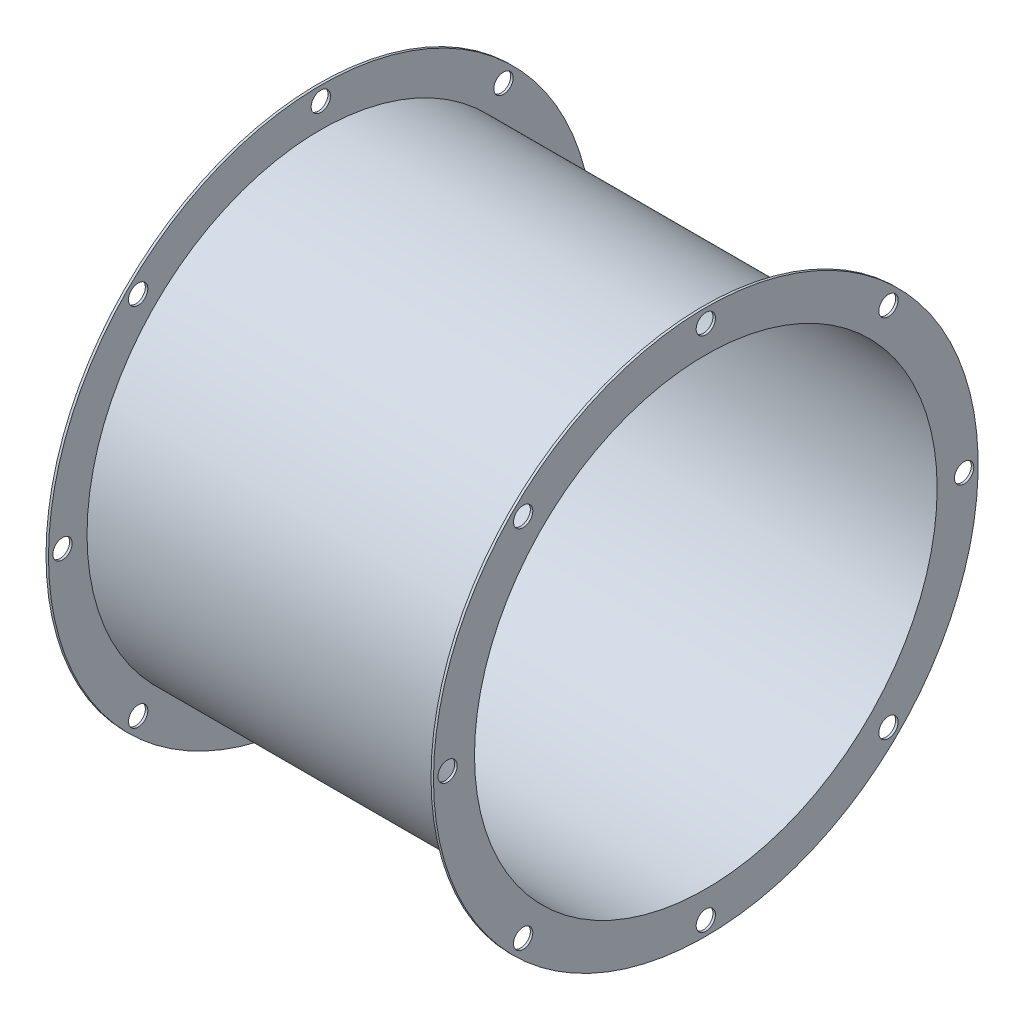
ISO-10303-21;
HEADER;
FILE_DESCRIPTION(('STEP AP214'),'2;1');
FILE_NAME('part.step','',(''),(''),'','','');
FILE_SCHEMA(('AUTOMOTIVE_DESIGN { 1 0 10303 214 1 1 1 1 }'));
ENDSEC;
DATA;
#1=APPLICATION_CONTEXT('core data for automotive mechanical design processes');
#2=APPLICATION_PROTOCOL_DEFINITION('international standard','automotive_design',2000,#1);
#3=PRODUCT_CONTEXT('',#1,'mechanical');
#4=PRODUCT('Part','Part','',(#3));
#5=PRODUCT_RELATED_PRODUCT_CATEGORY('part','',(#4));
#6=PRODUCT_DEFINITION_FORMATION('','',#4);
#7=PRODUCT_DEFINITION_CONTEXT('part definition',#1,'design');
#8=PRODUCT_DEFINITION('design','',#6,#7);
#9=PRODUCT_DEFINITION_SHAPE('','',#8);
#10=(LENGTH_UNIT() NAMED_UNIT(*) SI_UNIT(.MILLI.,.METRE.));
#11=(NAMED_UNIT(*) PLANE_ANGLE_UNIT() SI_UNIT($,.RADIAN.));
#12=(NAMED_UNIT(*) SI_UNIT($,.STERADIAN.) SOLID_ANGLE_UNIT());
#13=UNCERTAINTY_MEASURE_WITH_UNIT(LENGTH_MEASURE(1.E-05),#10,'distance_accuracy_value','');
#14=(GEOMETRIC_REPRESENTATION_CONTEXT(3) GLOBAL_UNCERTAINTY_ASSIGNED_CONTEXT((#13)) GLOBAL_UNIT_ASSIGNED_CONTEXT((#10,
#11,#12)) REPRESENTATION_CONTEXT('',''));
#15=CARTESIAN_POINT('',(0.,0.,0.));
#16=DIRECTION('',(0.,0.,1.));
#17=DIRECTION('',(1.,0.,0.));
#18=AXIS2_PLACEMENT_3D('',#15,#16,#17);
#19=CARTESIAN_POINT('',(0.,89.7128,0.));
#20=DIRECTION('',(1.,0.,0.));
#21=DIRECTION('',(0.,0.,-1.));
#22=AXIS2_PLACEMENT_3D('',#19,#20,#21);
#23=PLANE('',#22);
#24=CARTESIAN_POINT('',(0.,-2.97090147122162E-13,85.09));
#25=DIRECTION('',(1.,0.,0.));
#26=DIRECTION('',(0.,1.,0.));
#27=AXIS2_PLACEMENT_3D('',#24,#25,#26);
#28=CIRCLE('',#27,3.175);
#29=CARTESIAN_POINT('',(0.,3.1749999999997,85.09));
#30=VERTEX_POINT('',#29);
#31=EDGE_CURVE('E442',#30,#30,#28,.T.);
#32=ORIENTED_EDGE('',*,*,#31,.T.);
#33=EDGE_LOOP('',(#32));
#34=FACE_BOUND('',#33,.T.);
#35=CARTESIAN_POINT('',(0.,-60.1677160111636,60.167716011163));
#36=DIRECTION('',(1.,0.,0.));
#37=DIRECTION('',(0.,0.707106781186544,0.707106781186551));
#38=AXIS2_PLACEMENT_3D('',#35,#36,#37);
#39=CIRCLE('',#38,3.175);
#40=CARTESIAN_POINT('',(0.,-57.9226519808964,62.4127800414303));
#41=VERTEX_POINT('',#40);
#42=EDGE_CURVE('E452',#41,#41,#39,.T.);
#43=ORIENTED_EDGE('',*,*,#42,.T.);
#44=EDGE_LOOP('',(#43));
#45=FACE_BOUND('',#44,.T.);
#46=CARTESIAN_POINT('',(0.,-85.09,0.));
#47=DIRECTION('',(1.,0.,0.));
#48=DIRECTION('',(0.,0.,1.));
#49=AXIS2_PLACEMENT_3D('',#46,#47,#48);
#50=CIRCLE('',#49,3.175);
#51=CARTESIAN_POINT('',(0.,-85.09,3.175));
#52=VERTEX_POINT('',#51);
#53=EDGE_CURVE('E457',#52,#52,#50,.T.);
#54=ORIENTED_EDGE('',*,*,#53,.T.);
#55=EDGE_LOOP('',(#54));
#56=FACE_BOUND('',#55,.T.);
#57=CARTESIAN_POINT('',(0.,-60.1677160111628,-60.1677160111638));
#58=DIRECTION('',(1.,0.,0.));
#59=DIRECTION('',(0.,-0.707106781186554,0.707106781186541));
#60=AXIS2_PLACEMENT_3D('',#57,#58,#59);
#61=CIRCLE('',#60,3.175);
#62=CARTESIAN_POINT('',(0.,-62.4127800414301,-57.9226519808966));
#63=VERTEX_POINT('',#62);
#64=EDGE_CURVE('E465',#63,#63,#61,.T.);
#65=ORIENTED_EDGE('',*,*,#64,.T.);
#66=EDGE_LOOP('',(#65));
#67=FACE_BOUND('',#66,.T.);
#68=CARTESIAN_POINT('',(0.,8.91270441366487E-13,-85.09));
#69=DIRECTION('',(1.,0.,0.));
#70=DIRECTION('',(0.,-1.,0.));
#71=AXIS2_PLACEMENT_3D('',#68,#69,#70);
#72=CIRCLE('',#71,3.175);
#73=CARTESIAN_POINT('',(0.,-3.17499999999911,-85.09));
#74=VERTEX_POINT('',#73);
#75=EDGE_CURVE('E218',#74,#74,#72,.T.);
#76=ORIENTED_EDGE('',*,*,#75,.T.);
#77=EDGE_LOOP('',(#76));
#78=FACE_BOUND('',#77,.T.);
#79=CARTESIAN_POINT('',(0.,60.1677160111641,-60.1677160111626));
#80=DIRECTION('',(1.,0.,0.));
#81=DIRECTION('',(0.,-0.707106781186539,-0.707106781186556));
#82=AXIS2_PLACEMENT_3D('',#79,#80,#81);
#83=CIRCLE('',#82,3.175);
#84=CARTESIAN_POINT('',(0.,57.9226519808968,-62.4127800414299));
#85=VERTEX_POINT('',#84);
#86=EDGE_CURVE('E460',#85,#85,#83,.T.);
#87=ORIENTED_EDGE('',*,*,#86,.T.);
#88=EDGE_LOOP('',(#87));
#89=FACE_BOUND('',#88,.T.);
#90=CARTESIAN_POINT('',(0.,60.1677160111632,60.1677160111634));
#91=DIRECTION('',(1.,0.,0.));
#92=DIRECTION('',(0.,0.707106781186549,-0.707106781186546));
#93=AXIS2_PLACEMENT_3D('',#90,#91,#92);
#94=CIRCLE('',#93,3.175);
#95=CARTESIAN_POINT('',(0.,62.4127800414305,57.9226519808961));
#96=VERTEX_POINT('',#95);
#97=EDGE_CURVE('E60',#96,#96,#94,.T.);
#98=ORIENTED_EDGE('',*,*,#97,.T.);
#99=EDGE_LOOP('',(#98));
#100=FACE_BOUND('',#99,.T.);
#101=CARTESIAN_POINT('',(0.,85.09,0.));
#102=DIRECTION('',(1.,0.,0.));
#103=DIRECTION('',(0.,0.,-1.));
#104=AXIS2_PLACEMENT_3D('',#101,#102,#103);
#105=CIRCLE('',#104,3.175);
#106=CARTESIAN_POINT('',(0.,85.09,-3.175));
#107=VERTEX_POINT('',#106);
#108=EDGE_CURVE('E55',#107,#107,#105,.T.);
#109=ORIENTED_EDGE('',*,*,#108,.T.);
#110=EDGE_LOOP('',(#109));
#111=FACE_BOUND('',#110,.T.);
#112=CARTESIAN_POINT('',(0.,0.,0.));
#113=DIRECTION('',(-1.,0.,0.));
#114=DIRECTION('',(0.,0.,1.));
#115=AXIS2_PLACEMENT_3D('',#112,#113,#114);
#116=CIRCLE('',#115,76.2);
#117=CARTESIAN_POINT('',(0.,0.,76.2));
#118=VERTEX_POINT('',#117);
#119=EDGE_CURVE('E10',#118,#118,#116,.T.);
#120=ORIENTED_EDGE('',*,*,#119,.F.);
#121=EDGE_LOOP('',(#120));
#122=FACE_BOUND('',#121,.T.);
#123=CARTESIAN_POINT('',(0.,0.,0.));
#124=DIRECTION('',(-1.,0.,0.));
#125=DIRECTION('',(0.,0.,1.));
#126=AXIS2_PLACEMENT_3D('',#123,#124,#125);
#127=CIRCLE('',#126,89.7128);
#128=CARTESIAN_POINT('',(0.,0.,89.7128));
#129=VERTEX_POINT('',#128);
#130=EDGE_CURVE('E112',#129,#129,#127,.T.);
#131=ORIENTED_EDGE('',*,*,#130,.T.);
#132=EDGE_LOOP('',(#131));
#133=FACE_BOUND('',#132,.T.);
#134=ADVANCED_FACE('F35',(#34,#45,#56,#67,#78,#89,#100,#111,#122,#133),#23,.F.);
#135=CARTESIAN_POINT('',(0.,0.,0.));
#136=DIRECTION('',(-1.,0.,0.));
#137=DIRECTION('',(0.,0.,1.));
#138=AXIS2_PLACEMENT_3D('',#135,#136,#137);
#139=CYLINDRICAL_SURFACE('',#138,76.2);
#140=CARTESIAN_POINT('',(127.635,0.,0.));
#141=DIRECTION('',(-1.,0.,0.));
#142=DIRECTION('',(0.,0.,1.));
#143=AXIS2_PLACEMENT_3D('',#140,#141,#142);
#144=CIRCLE('',#143,76.2);
#145=CARTESIAN_POINT('',(127.635,0.,76.2));
#146=VERTEX_POINT('',#145);
#147=EDGE_CURVE('E42',#146,#146,#144,.T.);
#148=ORIENTED_EDGE('',*,*,#147,.F.);
#149=EDGE_LOOP('',(#148));
#150=FACE_BOUND('',#149,.T.);
#151=ORIENTED_EDGE('',*,*,#119,.T.);
#152=EDGE_LOOP('',(#151));
#153=FACE_BOUND('',#152,.T.);
#154=ADVANCED_FACE('F134',(#150,#153),#139,.F.);
#155=CARTESIAN_POINT('',(127.635,76.2,0.));
#156=DIRECTION('',(-1.,0.,0.));
#157=DIRECTION('',(0.,0.,1.));
#158=AXIS2_PLACEMENT_3D('',#155,#156,#157);
#159=PLANE('',#158);
#160=CARTESIAN_POINT('',(127.635,-2.97090147122162E-13,85.09));
#161=DIRECTION('',(-1.,0.,0.));
#162=DIRECTION('',(0.,0.,1.));
#163=AXIS2_PLACEMENT_3D('',#160,#161,#162);
#164=CIRCLE('',#163,3.175);
#165=CARTESIAN_POINT('',(127.635,-2.97090147122162E-13,88.265));
#166=VERTEX_POINT('',#165);
#167=EDGE_CURVE('E102',#166,#166,#164,.F.);
#168=ORIENTED_EDGE('',*,*,#167,.F.);
#169=EDGE_LOOP('',(#168));
#170=FACE_BOUND('',#169,.T.);
#171=CARTESIAN_POINT('',(127.635,-60.1677160111636,60.167716011163));
#172=DIRECTION('',(-1.,0.,0.));
#173=DIRECTION('',(0.,0.,1.));
#174=AXIS2_PLACEMENT_3D('',#171,#172,#173);
#175=CIRCLE('',#174,3.175);
#176=CARTESIAN_POINT('',(127.635,-60.1677160111636,63.342716011163));
#177=VERTEX_POINT('',#176);
#178=EDGE_CURVE('E87',#177,#177,#175,.F.);
#179=ORIENTED_EDGE('',*,*,#178,.F.);
#180=EDGE_LOOP('',(#179));
#181=FACE_BOUND('',#180,.T.);
#182=CARTESIAN_POINT('',(127.635,-85.09,0.));
#183=DIRECTION('',(-1.,0.,0.));
#184=DIRECTION('',(0.,0.,1.));
#185=AXIS2_PLACEMENT_3D('',#182,#183,#184);
#186=CIRCLE('',#185,3.175);
#187=CARTESIAN_POINT('',(127.635,-85.09,3.175));
#188=VERTEX_POINT('',#187);
#189=EDGE_CURVE('E83',#188,#188,#186,.F.);
#190=ORIENTED_EDGE('',*,*,#189,.F.);
#191=EDGE_LOOP('',(#190));
#192=FACE_BOUND('',#191,.T.);
#193=CARTESIAN_POINT('',(127.635,-60.1677160111628,-60.1677160111638));
#194=DIRECTION('',(-1.,0.,0.));
#195=DIRECTION('',(0.,0.,1.));
#196=AXIS2_PLACEMENT_3D('',#193,#194,#195);
#197=CIRCLE('',#196,3.175);
#198=CARTESIAN_POINT('',(127.635,-60.1677160111628,-56.9927160111638));
#199=VERTEX_POINT('',#198);
#200=EDGE_CURVE('E79',#199,#199,#197,.F.);
#201=ORIENTED_EDGE('',*,*,#200,.F.);
#202=EDGE_LOOP('',(#201));
#203=FACE_BOUND('',#202,.T.);
#204=CARTESIAN_POINT('',(127.635,8.91270441366487E-13,-85.09));
#205=DIRECTION('',(-1.,0.,0.));
#206=DIRECTION('',(0.,0.,1.));
#207=AXIS2_PLACEMENT_3D('',#204,#205,#206);
#208=CIRCLE('',#207,3.175);
#209=CARTESIAN_POINT('',(127.635,8.91270441366487E-13,-81.915));
#210=VERTEX_POINT('',#209);
#211=EDGE_CURVE('E75',#210,#210,#208,.F.);
#212=ORIENTED_EDGE('',*,*,#211,.F.);
#213=EDGE_LOOP('',(#212));
#214=FACE_BOUND('',#213,.T.);
#215=CARTESIAN_POINT('',(127.635,60.1677160111641,-60.1677160111626));
#216=DIRECTION('',(-1.,0.,0.));
#217=DIRECTION('',(0.,0.,1.));
#218=AXIS2_PLACEMENT_3D('',#215,#216,#217);
#219=CIRCLE('',#218,3.175);
#220=CARTESIAN_POINT('',(127.635,60.1677160111641,-56.9927160111626));
#221=VERTEX_POINT('',#220);
#222=EDGE_CURVE('E70',#221,#221,#219,.F.);
#223=ORIENTED_EDGE('',*,*,#222,.F.);
#224=EDGE_LOOP('',(#223));
#225=FACE_BOUND('',#224,.T.);
#226=CARTESIAN_POINT('',(127.635,60.1677160111632,60.1677160111634));
#227=DIRECTION('',(-1.,0.,0.));
#228=DIRECTION('',(0.,0.,1.));
#229=AXIS2_PLACEMENT_3D('',#226,#227,#228);
#230=CIRCLE('',#229,3.175);
#231=CARTESIAN_POINT('',(127.635,60.1677160111632,63.3427160111634));
#232=VERTEX_POINT('',#231);
#233=EDGE_CURVE('E65',#232,#232,#230,.F.);
#234=ORIENTED_EDGE('',*,*,#233,.F.);
#235=EDGE_LOOP('',(#234));
#236=FACE_BOUND('',#235,.T.);
#237=CARTESIAN_POINT('',(127.635,85.09,0.));
#238=DIRECTION('',(-1.,0.,0.));
#239=DIRECTION('',(0.,0.,1.));
#240=AXIS2_PLACEMENT_3D('',#237,#238,#239);
#241=CIRCLE('',#240,3.175);
#242=CARTESIAN_POINT('',(127.635,85.09,3.175));
#243=VERTEX_POINT('',#242);
#244=EDGE_CURVE('E109',#243,#243,#241,.F.);
#245=ORIENTED_EDGE('',*,*,#244,.F.);
#246=EDGE_LOOP('',(#245));
#247=FACE_BOUND('',#246,.T.);
#248=CARTESIAN_POINT('',(127.635,0.,0.));
#249=DIRECTION('',(-1.,0.,0.));
#250=DIRECTION('',(0.,0.,1.));
#251=AXIS2_PLACEMENT_3D('',#248,#249,#250);
#252=CIRCLE('',#251,89.7128);
#253=CARTESIAN_POINT('',(127.635,0.,89.7128));
#254=VERTEX_POINT('',#253);
#255=EDGE_CURVE('E47',#254,#254,#252,.T.);
#256=ORIENTED_EDGE('',*,*,#255,.F.);
#257=EDGE_LOOP('',(#256));
#258=FACE_BOUND('',#257,.T.);
#259=ORIENTED_EDGE('',*,*,#147,.T.);
#260=EDGE_LOOP('',(#259));
#261=FACE_BOUND('',#260,.T.);
#262=ADVANCED_FACE('F131',(#170,#181,#192,#203,#214,#225,#236,#247,#258,#261),#159,.F.);
#263=CARTESIAN_POINT('',(0.,0.,0.));
#264=DIRECTION('',(-1.,0.,0.));
#265=DIRECTION('',(0.,0.,1.));
#266=AXIS2_PLACEMENT_3D('',#263,#264,#265);
#267=CYLINDRICAL_SURFACE('',#266,89.7128);
#268=CARTESIAN_POINT('',(126.8222,0.,0.));
#269=DIRECTION('',(-1.,0.,0.));
#270=DIRECTION('',(0.,0.,1.));
#271=AXIS2_PLACEMENT_3D('',#268,#269,#270);
#272=CIRCLE('',#271,89.7128);
#273=CARTESIAN_POINT('',(126.8222,0.,89.7128));
#274=VERTEX_POINT('',#273);
#275=EDGE_CURVE('E124',#274,#274,#272,.T.);
#276=ORIENTED_EDGE('',*,*,#275,.F.);
#277=EDGE_LOOP('',(#276));
#278=FACE_BOUND('',#277,.T.);
#279=ORIENTED_EDGE('',*,*,#255,.T.);
#280=EDGE_LOOP('',(#279));
#281=FACE_BOUND('',#280,.T.);
#282=ADVANCED_FACE('F129',(#278,#281),#267,.T.);
#283=CARTESIAN_POINT('',(126.8222,89.7128,0.));
#284=DIRECTION('',(1.,0.,0.));
#285=DIRECTION('',(0.,0.,-1.));
#286=AXIS2_PLACEMENT_3D('',#283,#284,#285);
#287=PLANE('',#286);
#288=CARTESIAN_POINT('',(126.8222,-2.97090147122162E-13,85.09));
#289=DIRECTION('',(1.,0.,0.));
#290=DIRECTION('',(0.,0.,-1.));
#291=AXIS2_PLACEMENT_3D('',#288,#289,#290);
#292=CIRCLE('',#291,3.175);
#293=CARTESIAN_POINT('',(126.8222,-2.97090147122162E-13,81.915));
#294=VERTEX_POINT('',#293);
#295=EDGE_CURVE('E99',#294,#294,#292,.F.);
#296=ORIENTED_EDGE('',*,*,#295,.F.);
#297=EDGE_LOOP('',(#296));
#298=FACE_BOUND('',#297,.T.);
#299=CARTESIAN_POINT('',(126.8222,-60.1677160111636,60.167716011163));
#300=DIRECTION('',(1.,0.,0.));
#301=DIRECTION('',(0.,0.,-1.));
#302=AXIS2_PLACEMENT_3D('',#299,#300,#301);
#303=CIRCLE('',#302,3.175);
#304=CARTESIAN_POINT('',(126.8222,-60.1677160111636,56.992716011163));
#305=VERTEX_POINT('',#304);
#306=EDGE_CURVE('E82',#305,#305,#303,.F.);
#307=ORIENTED_EDGE('',*,*,#306,.F.);
#308=EDGE_LOOP('',(#307));
#309=FACE_BOUND('',#308,.T.);
#310=CARTESIAN_POINT('',(126.8222,-85.09,0.));
#311=DIRECTION('',(1.,0.,0.));
#312=DIRECTION('',(0.,0.,-1.));
#313=AXIS2_PLACEMENT_3D('',#310,#311,#312);
#314=CIRCLE('',#313,3.175);
#315=CARTESIAN_POINT('',(126.8222,-85.09,-3.175));
#316=VERTEX_POINT('',#315);
#317=EDGE_CURVE('E78',#316,#316,#314,.F.);
#318=ORIENTED_EDGE('',*,*,#317,.F.);
#319=EDGE_LOOP('',(#318));
#320=FACE_BOUND('',#319,.T.);
#321=CARTESIAN_POINT('',(126.8222,-60.1677160111628,-60.1677160111638));
#322=DIRECTION('',(1.,0.,0.));
#323=DIRECTION('',(0.,0.,-1.));
#324=AXIS2_PLACEMENT_3D('',#321,#322,#323);
#325=CIRCLE('',#324,3.175);
#326=CARTESIAN_POINT('',(126.8222,-60.1677160111628,-63.3427160111639));
#327=VERTEX_POINT('',#326);
#328=EDGE_CURVE('E74',#327,#327,#325,.F.);
#329=ORIENTED_EDGE('',*,*,#328,.F.);
#330=EDGE_LOOP('',(#329));
#331=FACE_BOUND('',#330,.T.);
#332=CARTESIAN_POINT('',(126.8222,8.91270441366487E-13,-85.09));
#333=DIRECTION('',(1.,0.,0.));
#334=DIRECTION('',(0.,0.,-1.));
#335=AXIS2_PLACEMENT_3D('',#332,#333,#334);
#336=CIRCLE('',#335,3.175);
#337=CARTESIAN_POINT('',(126.8222,8.91270441366487E-13,-88.265));
#338=VERTEX_POINT('',#337);
#339=EDGE_CURVE('E69',#338,#338,#336,.F.);
#340=ORIENTED_EDGE('',*,*,#339,.F.);
#341=EDGE_LOOP('',(#340));
#342=FACE_BOUND('',#341,.T.);
#343=CARTESIAN_POINT('',(126.8222,60.1677160111641,-60.1677160111626));
#344=DIRECTION('',(1.,0.,0.));
#345=DIRECTION('',(0.,0.,-1.));
#346=AXIS2_PLACEMENT_3D('',#343,#344,#345);
#347=CIRCLE('',#346,3.175);
#348=CARTESIAN_POINT('',(126.8222,60.1677160111641,-63.3427160111626));
#349=VERTEX_POINT('',#348);
#350=EDGE_CURVE('E64',#349,#349,#347,.F.);
#351=ORIENTED_EDGE('',*,*,#350,.F.);
#352=EDGE_LOOP('',(#351));
#353=FACE_BOUND('',#352,.T.);
#354=CARTESIAN_POINT('',(126.8222,60.1677160111632,60.1677160111634));
#355=DIRECTION('',(1.,0.,0.));
#356=DIRECTION('',(0.,0.,-1.));
#357=AXIS2_PLACEMENT_3D('',#354,#355,#356);
#358=CIRCLE('',#357,3.175);
#359=CARTESIAN_POINT('',(126.8222,60.1677160111632,56.9927160111634));
#360=VERTEX_POINT('',#359);
#361=EDGE_CURVE('E59',#360,#360,#358,.F.);
#362=ORIENTED_EDGE('',*,*,#361,.F.);
#363=EDGE_LOOP('',(#362));
#364=FACE_BOUND('',#363,.T.);
#365=CARTESIAN_POINT('',(126.8222,85.09,0.));
#366=DIRECTION('',(1.,0.,0.));
#367=DIRECTION('',(0.,0.,-1.));
#368=AXIS2_PLACEMENT_3D('',#365,#366,#367);
#369=CIRCLE('',#368,3.175);
#370=CARTESIAN_POINT('',(126.8222,85.09,-3.175));
#371=VERTEX_POINT('',#370);
#372=EDGE_CURVE('E54',#371,#371,#369,.F.);
#373=ORIENTED_EDGE('',*,*,#372,.F.);
#374=EDGE_LOOP('',(#373));
#375=FACE_BOUND('',#374,.T.);
#376=CARTESIAN_POINT('',(126.8222,0.,0.));
#377=DIRECTION('',(-1.,0.,0.));
#378=DIRECTION('',(0.,0.,1.));
#379=AXIS2_PLACEMENT_3D('',#376,#377,#378);
#380=CIRCLE('',#379,77.0128);
#381=CARTESIAN_POINT('',(126.8222,0.,77.0128));
#382=VERTEX_POINT('',#381);
#383=EDGE_CURVE('E121',#382,#382,#380,.T.);
#384=ORIENTED_EDGE('',*,*,#383,.F.);
#385=EDGE_LOOP('',(#384));
#386=FACE_BOUND('',#385,.T.);
#387=ORIENTED_EDGE('',*,*,#275,.T.);
#388=EDGE_LOOP('',(#387));
#389=FACE_BOUND('',#388,.T.);
#390=ADVANCED_FACE('F147',(#298,#309,#320,#331,#342,#353,#364,#375,#386,#389),#287,.F.);
#391=CARTESIAN_POINT('',(0.,0.,0.));
#392=DIRECTION('',(-1.,0.,0.));
#393=DIRECTION('',(0.,0.,1.));
#394=AXIS2_PLACEMENT_3D('',#391,#392,#393);
#395=CYLINDRICAL_SURFACE('',#394,77.0128);
#396=CARTESIAN_POINT('',(0.8128,0.,0.));
#397=DIRECTION('',(-1.,0.,0.));
#398=DIRECTION('',(0.,0.,1.));
#399=AXIS2_PLACEMENT_3D('',#396,#397,#398);
#400=CIRCLE('',#399,77.0128);
#401=CARTESIAN_POINT('',(0.8128,0.,77.0128));
#402=VERTEX_POINT('',#401);
#403=EDGE_CURVE('E118',#402,#402,#400,.T.);
#404=ORIENTED_EDGE('',*,*,#403,.F.);
#405=EDGE_LOOP('',(#404));
#406=FACE_BOUND('',#405,.T.);
#407=ORIENTED_EDGE('',*,*,#383,.T.);
#408=EDGE_LOOP('',(#407));
#409=FACE_BOUND('',#408,.T.);
#410=ADVANCED_FACE('F151',(#406,#409),#395,.T.);
#411=CARTESIAN_POINT('',(0.8128,77.0128,0.));
#412=DIRECTION('',(-1.,0.,0.));
#413=DIRECTION('',(0.,0.,1.));
#414=AXIS2_PLACEMENT_3D('',#411,#412,#413);
#415=PLANE('',#414);
#416=CARTESIAN_POINT('',(0.812800000000002,-2.97090147122162E-13,85.09));
#417=DIRECTION('',(-1.,0.,0.));
#418=DIRECTION('',(0.,0.,1.));
#419=AXIS2_PLACEMENT_3D('',#416,#417,#418);
#420=CIRCLE('',#419,3.175);
#421=CARTESIAN_POINT('',(0.812800000000002,-2.97090147122162E-13,88.265));
#422=VERTEX_POINT('',#421);
#423=EDGE_CURVE('E38',#422,#422,#420,.F.);
#424=ORIENTED_EDGE('',*,*,#423,.F.);
#425=EDGE_LOOP('',(#424));
#426=FACE_BOUND('',#425,.T.);
#427=CARTESIAN_POINT('',(0.812800000000002,-60.1677160111636,60.167716011163));
#428=DIRECTION('',(-1.,0.,0.));
#429=DIRECTION('',(0.,0.,1.));
#430=AXIS2_PLACEMENT_3D('',#427,#428,#429);
#431=CIRCLE('',#430,3.175);
#432=CARTESIAN_POINT('',(0.812800000000002,-60.1677160111636,63.342716011163));
#433=VERTEX_POINT('',#432);
#434=EDGE_CURVE('E80',#433,#433,#431,.F.);
#435=ORIENTED_EDGE('',*,*,#434,.F.);
#436=EDGE_LOOP('',(#435));
#437=FACE_BOUND('',#436,.T.);
#438=CARTESIAN_POINT('',(0.812800000000002,-85.09,0.));
#439=DIRECTION('',(-1.,0.,0.));
#440=DIRECTION('',(0.,0.,1.));
#441=AXIS2_PLACEMENT_3D('',#438,#439,#440);
#442=CIRCLE('',#441,3.175);
#443=CARTESIAN_POINT('',(0.812800000000002,-85.09,3.175));
#444=VERTEX_POINT('',#443);
#445=EDGE_CURVE('E76',#444,#444,#442,.F.);
#446=ORIENTED_EDGE('',*,*,#445,.F.);
#447=EDGE_LOOP('',(#446));
#448=FACE_BOUND('',#447,.T.);
#449=CARTESIAN_POINT('',(0.812800000000002,-60.1677160111628,-60.1677160111638));
#450=DIRECTION('',(-1.,0.,0.));
#451=DIRECTION('',(0.,0.,1.));
#452=AXIS2_PLACEMENT_3D('',#449,#450,#451);
#453=CIRCLE('',#452,3.175);
#454=CARTESIAN_POINT('',(0.812800000000002,-60.1677160111628,-56.9927160111638));
#455=VERTEX_POINT('',#454);
#456=EDGE_CURVE('E71',#455,#455,#453,.F.);
#457=ORIENTED_EDGE('',*,*,#456,.F.);
#458=EDGE_LOOP('',(#457));
#459=FACE_BOUND('',#458,.T.);
#460=CARTESIAN_POINT('',(0.812800000000002,8.91270441366487E-13,-85.09));
#461=DIRECTION('',(-1.,0.,0.));
#462=DIRECTION('',(0.,0.,1.));
#463=AXIS2_PLACEMENT_3D('',#460,#461,#462);
#464=CIRCLE('',#463,3.175);
#465=CARTESIAN_POINT('',(0.812800000000002,8.91270441366487E-13,-81.915));
#466=VERTEX_POINT('',#465);
#467=EDGE_CURVE('E66',#466,#466,#464,.F.);
#468=ORIENTED_EDGE('',*,*,#467,.F.);
#469=EDGE_LOOP('',(#468));
#470=FACE_BOUND('',#469,.T.);
#471=CARTESIAN_POINT('',(0.812800000000002,60.1677160111641,-60.1677160111626));
#472=DIRECTION('',(-1.,0.,0.));
#473=DIRECTION('',(0.,0.,1.));
#474=AXIS2_PLACEMENT_3D('',#471,#472,#473);
#475=CIRCLE('',#474,3.175);
#476=CARTESIAN_POINT('',(0.812800000000002,60.1677160111641,-56.9927160111626));
#477=VERTEX_POINT('',#476);
#478=EDGE_CURVE('E61',#477,#477,#475,.F.);
#479=ORIENTED_EDGE('',*,*,#478,.F.);
#480=EDGE_LOOP('',(#479));
#481=FACE_BOUND('',#480,.T.);
#482=CARTESIAN_POINT('',(0.812800000000002,60.1677160111632,60.1677160111634));
#483=DIRECTION('',(-1.,0.,0.));
#484=DIRECTION('',(0.,0.,1.));
#485=AXIS2_PLACEMENT_3D('',#482,#483,#484);
#486=CIRCLE('',#485,3.175);
#487=CARTESIAN_POINT('',(0.812800000000002,60.1677160111632,63.3427160111634));
#488=VERTEX_POINT('',#487);
#489=EDGE_CURVE('E56',#488,#488,#486,.F.);
#490=ORIENTED_EDGE('',*,*,#489,.F.);
#491=EDGE_LOOP('',(#490));
#492=FACE_BOUND('',#491,.T.);
#493=CARTESIAN_POINT('',(0.812800000000002,85.09,0.));
#494=DIRECTION('',(-1.,0.,0.));
#495=DIRECTION('',(0.,0.,1.));
#496=AXIS2_PLACEMENT_3D('',#493,#494,#495);
#497=CIRCLE('',#496,3.175);
#498=CARTESIAN_POINT('',(0.812800000000002,85.09,3.175));
#499=VERTEX_POINT('',#498);
#500=EDGE_CURVE('E51',#499,#499,#497,.F.);
#501=ORIENTED_EDGE('',*,*,#500,.F.);
#502=EDGE_LOOP('',(#501));
#503=FACE_BOUND('',#502,.T.);
#504=CARTESIAN_POINT('',(0.8128,0.,0.));
#505=DIRECTION('',(-1.,0.,0.));
#506=DIRECTION('',(0.,0.,1.));
#507=AXIS2_PLACEMENT_3D('',#504,#505,#506);
#508=CIRCLE('',#507,89.7128);
#509=CARTESIAN_POINT('',(0.8128,0.,89.7128));
#510=VERTEX_POINT('',#509);
#511=EDGE_CURVE('E115',#510,#510,#508,.T.);
#512=ORIENTED_EDGE('',*,*,#511,.F.);
#513=EDGE_LOOP('',(#512));
#514=FACE_BOUND('',#513,.T.);
#515=ORIENTED_EDGE('',*,*,#403,.T.);
#516=EDGE_LOOP('',(#515));
#517=FACE_BOUND('',#516,.T.);
#518=ADVANCED_FACE('F155',(#426,#437,#448,#459,#470,#481,#492,#503,#514,#517),#415,.F.);
#519=CARTESIAN_POINT('',(0.,0.,0.));
#520=DIRECTION('',(-1.,0.,0.));
#521=DIRECTION('',(0.,0.,1.));
#522=AXIS2_PLACEMENT_3D('',#519,#520,#521);
#523=CYLINDRICAL_SURFACE('',#522,89.7128);
#524=ORIENTED_EDGE('',*,*,#130,.F.);
#525=EDGE_LOOP('',(#524));
#526=FACE_BOUND('',#525,.T.);
#527=ORIENTED_EDGE('',*,*,#511,.T.);
#528=EDGE_LOOP('',(#527));
#529=FACE_BOUND('',#528,.T.);
#530=ADVANCED_FACE('F159',(#526,#529),#523,.T.);
#531=CARTESIAN_POINT('',(224.79,85.09,0.));
#532=DIRECTION('',(-1.,0.,0.));
#533=DIRECTION('',(0.,0.,1.));
#534=AXIS2_PLACEMENT_3D('',#531,#532,#533);
#535=CYLINDRICAL_SURFACE('',#534,3.175);
#536=ORIENTED_EDGE('',*,*,#108,.F.);
#537=EDGE_LOOP('',(#536));
#538=FACE_BOUND('',#537,.T.);
#539=ORIENTED_EDGE('',*,*,#500,.T.);
#540=EDGE_LOOP('',(#539));
#541=FACE_BOUND('',#540,.T.);
#542=ADVANCED_FACE('F163',(#538,#541),#535,.F.);
#543=ORIENTED_EDGE('',*,*,#372,.T.);
#544=EDGE_LOOP('',(#543));
#545=FACE_BOUND('',#544,.T.);
#546=ORIENTED_EDGE('',*,*,#244,.T.);
#547=EDGE_LOOP('',(#546));
#548=FACE_BOUND('',#547,.T.);
#549=ADVANCED_FACE('F165',(#545,#548),#535,.F.);
#550=CARTESIAN_POINT('',(224.79,60.1677160111632,60.1677160111634));
#551=DIRECTION('',(-1.,0.,0.));
#552=DIRECTION('',(0.,0.,1.));
#553=AXIS2_PLACEMENT_3D('',#550,#551,#552);
#554=CYLINDRICAL_SURFACE('',#553,3.175);
#555=ORIENTED_EDGE('',*,*,#97,.F.);
#556=EDGE_LOOP('',(#555));
#557=FACE_BOUND('',#556,.T.);
#558=ORIENTED_EDGE('',*,*,#489,.T.);
#559=EDGE_LOOP('',(#558));
#560=FACE_BOUND('',#559,.T.);
#561=ADVANCED_FACE('F168',(#557,#560),#554,.F.);
#562=CARTESIAN_POINT('',(224.79,60.1677160111641,-60.1677160111626));
#563=DIRECTION('',(-1.,0.,0.));
#564=DIRECTION('',(0.,0.,1.));
#565=AXIS2_PLACEMENT_3D('',#562,#563,#564);
#566=CYLINDRICAL_SURFACE('',#565,3.175);
#567=ORIENTED_EDGE('',*,*,#86,.F.);
#568=EDGE_LOOP('',(#567));
#569=FACE_BOUND('',#568,.T.);
#570=ORIENTED_EDGE('',*,*,#478,.T.);
#571=EDGE_LOOP('',(#570));
#572=FACE_BOUND('',#571,.T.);
#573=ADVANCED_FACE('F199',(#569,#572),#566,.F.);
#574=CARTESIAN_POINT('',(224.79,8.91270441366487E-13,-85.09));
#575=DIRECTION('',(-1.,0.,0.));
#576=DIRECTION('',(0.,0.,1.));
#577=AXIS2_PLACEMENT_3D('',#574,#575,#576);
#578=CYLINDRICAL_SURFACE('',#577,3.175);
#579=ORIENTED_EDGE('',*,*,#75,.F.);
#580=EDGE_LOOP('',(#579));
#581=FACE_BOUND('',#580,.T.);
#582=ORIENTED_EDGE('',*,*,#467,.T.);
#583=EDGE_LOOP('',(#582));
#584=FACE_BOUND('',#583,.T.);
#585=ADVANCED_FACE('F202',(#581,#584),#578,.F.);
#586=CARTESIAN_POINT('',(224.79,-60.1677160111628,-60.1677160111638));
#587=DIRECTION('',(-1.,0.,0.));
#588=DIRECTION('',(0.,0.,1.));
#589=AXIS2_PLACEMENT_3D('',#586,#587,#588);
#590=CYLINDRICAL_SURFACE('',#589,3.175);
#591=ORIENTED_EDGE('',*,*,#64,.F.);
#592=EDGE_LOOP('',(#591));
#593=FACE_BOUND('',#592,.T.);
#594=ORIENTED_EDGE('',*,*,#456,.T.);
#595=EDGE_LOOP('',(#594));
#596=FACE_BOUND('',#595,.T.);
#597=ADVANCED_FACE('F182',(#593,#596),#590,.F.);
#598=CARTESIAN_POINT('',(224.79,-85.09,0.));
#599=DIRECTION('',(-1.,0.,0.));
#600=DIRECTION('',(0.,0.,1.));
#601=AXIS2_PLACEMENT_3D('',#598,#599,#600);
#602=CYLINDRICAL_SURFACE('',#601,3.175);
#603=ORIENTED_EDGE('',*,*,#53,.F.);
#604=EDGE_LOOP('',(#603));
#605=FACE_BOUND('',#604,.T.);
#606=ORIENTED_EDGE('',*,*,#445,.T.);
#607=EDGE_LOOP('',(#606));
#608=FACE_BOUND('',#607,.T.);
#609=ADVANCED_FACE('F187',(#605,#608),#602,.F.);
#610=CARTESIAN_POINT('',(224.79,-60.1677160111636,60.167716011163));
#611=DIRECTION('',(-1.,0.,0.));
#612=DIRECTION('',(0.,0.,1.));
#613=AXIS2_PLACEMENT_3D('',#610,#611,#612);
#614=CYLINDRICAL_SURFACE('',#613,3.175);
#615=ORIENTED_EDGE('',*,*,#42,.F.);
#616=EDGE_LOOP('',(#615));
#617=FACE_BOUND('',#616,.T.);
#618=ORIENTED_EDGE('',*,*,#434,.T.);
#619=EDGE_LOOP('',(#618));
#620=FACE_BOUND('',#619,.T.);
#621=ADVANCED_FACE('F192',(#617,#620),#614,.F.);
#622=CARTESIAN_POINT('',(224.79,-2.97090147122162E-13,85.09));
#623=DIRECTION('',(-1.,0.,0.));
#624=DIRECTION('',(0.,0.,1.));
#625=AXIS2_PLACEMENT_3D('',#622,#623,#624);
#626=CYLINDRICAL_SURFACE('',#625,3.175);
#627=ORIENTED_EDGE('',*,*,#31,.F.);
#628=EDGE_LOOP('',(#627));
#629=FACE_BOUND('',#628,.T.);
#630=ORIENTED_EDGE('',*,*,#423,.T.);
#631=EDGE_LOOP('',(#630));
#632=FACE_BOUND('',#631,.T.);
#633=ADVANCED_FACE('F174',(#629,#632),#626,.F.);
#634=ORIENTED_EDGE('',*,*,#361,.T.);
#635=EDGE_LOOP('',(#634));
#636=FACE_BOUND('',#635,.T.);
#637=ORIENTED_EDGE('',*,*,#233,.T.);
#638=EDGE_LOOP('',(#637));
#639=FACE_BOUND('',#638,.T.);
#640=ADVANCED_FACE('F170',(#636,#639),#554,.F.);
#641=ORIENTED_EDGE('',*,*,#350,.T.);
#642=EDGE_LOOP('',(#641));
#643=FACE_BOUND('',#642,.T.);
#644=ORIENTED_EDGE('',*,*,#222,.T.);
#645=EDGE_LOOP('',(#644));
#646=FACE_BOUND('',#645,.T.);
#647=ADVANCED_FACE('F173',(#643,#646),#566,.F.);
#648=ORIENTED_EDGE('',*,*,#339,.T.);
#649=EDGE_LOOP('',(#648));
#650=FACE_BOUND('',#649,.T.);
#651=ORIENTED_EDGE('',*,*,#211,.T.);
#652=EDGE_LOOP('',(#651));
#653=FACE_BOUND('',#652,.T.);
#654=ADVANCED_FACE('F180',(#650,#653),#578,.F.);
#655=ORIENTED_EDGE('',*,*,#328,.T.);
#656=EDGE_LOOP('',(#655));
#657=FACE_BOUND('',#656,.T.);
#658=ORIENTED_EDGE('',*,*,#200,.T.);
#659=EDGE_LOOP('',(#658));
#660=FACE_BOUND('',#659,.T.);
#661=ADVANCED_FACE('F176',(#657,#660),#590,.F.);
#662=ORIENTED_EDGE('',*,*,#317,.T.);
#663=EDGE_LOOP('',(#662));
#664=FACE_BOUND('',#663,.T.);
#665=ORIENTED_EDGE('',*,*,#189,.T.);
#666=EDGE_LOOP('',(#665));
#667=FACE_BOUND('',#666,.T.);
#668=ADVANCED_FACE('F179',(#664,#667),#602,.F.);
#669=ORIENTED_EDGE('',*,*,#306,.T.);
#670=EDGE_LOOP('',(#669));
#671=FACE_BOUND('',#670,.T.);
#672=ORIENTED_EDGE('',*,*,#178,.T.);
#673=EDGE_LOOP('',(#672));
#674=FACE_BOUND('',#673,.T.);
#675=ADVANCED_FACE('F185',(#671,#674),#614,.F.);
#676=ORIENTED_EDGE('',*,*,#295,.T.);
#677=EDGE_LOOP('',(#676));
#678=FACE_BOUND('',#677,.T.);
#679=ORIENTED_EDGE('',*,*,#167,.T.);
#680=EDGE_LOOP('',(#679));
#681=FACE_BOUND('',#680,.T.);
#682=ADVANCED_FACE('F190',(#678,#681),#626,.F.);
#683=CLOSED_SHELL('',(#134,#154,#262,#282,#390,#410,#518,#530,#542,#549,#561,#573,#585,#597,
#609,#621,#633,#640,#647,#654,#661,#668,#675,#682));
#684=MANIFOLD_SOLID_BREP('B2',#683);
#685=ADVANCED_BREP_SHAPE_REPRESENTATION('',(#18,#684),#14);
#686=SHAPE_DEFINITION_REPRESENTATION(#9,#685);
ENDSEC;
END-ISO-10303-21;
